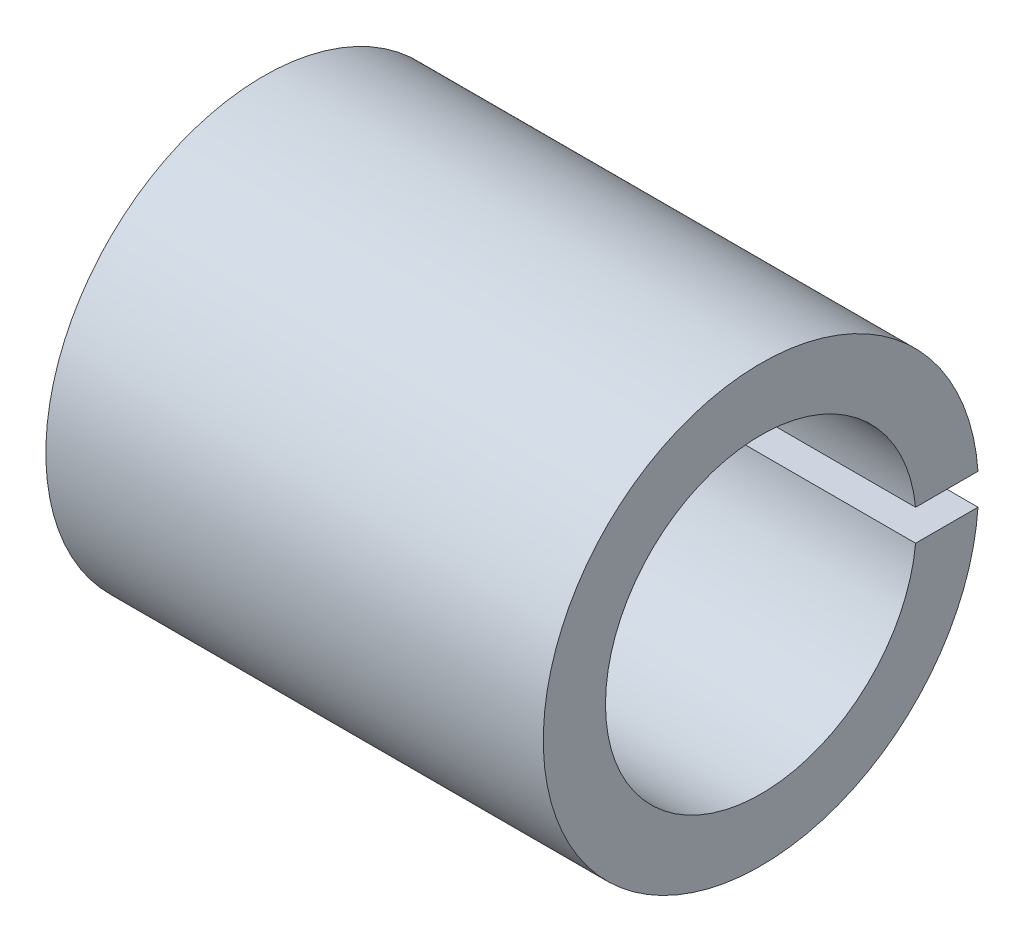
ISO-10303-21;
HEADER;
FILE_DESCRIPTION(('STEP AP214'),'2;1');
FILE_NAME('part.step','',(''),(''),'','','');
FILE_SCHEMA(('AUTOMOTIVE_DESIGN { 1 0 10303 214 1 1 1 1 }'));
ENDSEC;
DATA;
#1=APPLICATION_CONTEXT('core data for automotive mechanical design processes');
#2=APPLICATION_PROTOCOL_DEFINITION('international standard','automotive_design',2000,#1);
#3=PRODUCT_CONTEXT('',#1,'mechanical');
#4=PRODUCT('Part','Part','',(#3));
#5=PRODUCT_RELATED_PRODUCT_CATEGORY('part','',(#4));
#6=PRODUCT_DEFINITION_FORMATION('','',#4);
#7=PRODUCT_DEFINITION_CONTEXT('part definition',#1,'design');
#8=PRODUCT_DEFINITION('design','',#6,#7);
#9=PRODUCT_DEFINITION_SHAPE('','',#8);
#10=(LENGTH_UNIT() NAMED_UNIT(*) SI_UNIT(.MILLI.,.METRE.));
#11=(NAMED_UNIT(*) PLANE_ANGLE_UNIT() SI_UNIT($,.RADIAN.));
#12=(NAMED_UNIT(*) SI_UNIT($,.STERADIAN.) SOLID_ANGLE_UNIT());
#13=UNCERTAINTY_MEASURE_WITH_UNIT(LENGTH_MEASURE(1.E-05),#10,'distance_accuracy_value','');
#14=(GEOMETRIC_REPRESENTATION_CONTEXT(3) GLOBAL_UNCERTAINTY_ASSIGNED_CONTEXT((#13)) GLOBAL_UNIT_ASSIGNED_CONTEXT((#10,
#11,#12)) REPRESENTATION_CONTEXT('',''));
#15=CARTESIAN_POINT('',(0.,0.,0.));
#16=DIRECTION('',(0.,0.,1.));
#17=DIRECTION('',(1.,0.,0.));
#18=AXIS2_PLACEMENT_3D('',#15,#16,#17);
#19=CARTESIAN_POINT('',(8.,0.,0.));
#20=DIRECTION('',(-1.,0.,0.));
#21=DIRECTION('',(0.,0.,1.));
#22=AXIS2_PLACEMENT_3D('',#19,#20,#21);
#23=CYLINDRICAL_SURFACE('',#22,5.);
#24=CARTESIAN_POINT('',(-8.,0.,0.));
#25=DIRECTION('',(-1.,0.,0.));
#26=DIRECTION('',(0.,0.,-1.));
#27=AXIS2_PLACEMENT_3D('',#24,#25,#26);
#28=CIRCLE('',#27,5.);
#29=CARTESIAN_POINT('',(-8.,-0.5,-4.9749371855331));
#30=VERTEX_POINT('',#29);
#31=CARTESIAN_POINT('',(-8.,0.5,-4.9749371855331));
#32=VERTEX_POINT('',#31);
#33=EDGE_CURVE('E96',#30,#32,#28,.T.);
#34=ORIENTED_EDGE('',*,*,#33,.T.);
#35=DIRECTION('',(-1.,0.,0.));
#36=VECTOR('',#35,1.);
#37=CARTESIAN_POINT('',(8.,0.5,-4.9749371855331));
#38=LINE('',#37,#36);
#39=CARTESIAN_POINT('',(8.,0.5,-4.9749371855331));
#40=VERTEX_POINT('',#39);
#41=EDGE_CURVE('E11',#40,#32,#38,.T.);
#42=ORIENTED_EDGE('',*,*,#41,.F.);
#43=CARTESIAN_POINT('',(8.,0.,0.));
#44=DIRECTION('',(-1.,0.,0.));
#45=DIRECTION('',(0.,0.,-1.));
#46=AXIS2_PLACEMENT_3D('',#43,#44,#45);
#47=CIRCLE('',#46,5.);
#48=CARTESIAN_POINT('',(8.,-0.5,-4.9749371855331));
#49=VERTEX_POINT('',#48);
#50=EDGE_CURVE('E84',#49,#40,#47,.T.);
#51=ORIENTED_EDGE('',*,*,#50,.F.);
#52=DIRECTION('',(-1.,0.,0.));
#53=VECTOR('',#52,1.);
#54=CARTESIAN_POINT('',(8.,-0.5,-4.9749371855331));
#55=LINE('',#54,#53);
#56=EDGE_CURVE('E92',#49,#30,#55,.T.);
#57=ORIENTED_EDGE('',*,*,#56,.T.);
#58=EDGE_LOOP('',(#34,#42,#51,#57));
#59=FACE_BOUND('',#58,.T.);
#60=ADVANCED_FACE('F33',(#59),#23,.F.);
#61=CARTESIAN_POINT('',(8.,0.5,-4.9749371855331));
#62=DIRECTION('',(0.,1.,0.));
#63=DIRECTION('',(0.,0.,1.));
#64=AXIS2_PLACEMENT_3D('',#61,#62,#63);
#65=PLANE('',#64);
#66=DIRECTION('',(0.,0.,-1.));
#67=VECTOR('',#66,1.);
#68=CARTESIAN_POINT('',(-8.,0.5,-4.9749371855331));
#69=LINE('',#68,#67);
#70=CARTESIAN_POINT('',(-8.,0.5,-6.98212002188447));
#71=VERTEX_POINT('',#70);
#72=EDGE_CURVE('E88',#32,#71,#69,.T.);
#73=ORIENTED_EDGE('',*,*,#72,.T.);
#74=DIRECTION('',(-1.,0.,0.));
#75=VECTOR('',#74,1.);
#76=CARTESIAN_POINT('',(8.,0.5,-6.98212002188447));
#77=LINE('',#76,#75);
#78=CARTESIAN_POINT('',(8.,0.5,-6.98212002188447));
#79=VERTEX_POINT('',#78);
#80=EDGE_CURVE('E41',#79,#71,#77,.T.);
#81=ORIENTED_EDGE('',*,*,#80,.F.);
#82=DIRECTION('',(0.,0.,-1.));
#83=VECTOR('',#82,1.);
#84=CARTESIAN_POINT('',(8.,0.5,-4.9749371855331));
#85=LINE('',#84,#83);
#86=EDGE_CURVE('E79',#40,#79,#85,.T.);
#87=ORIENTED_EDGE('',*,*,#86,.F.);
#88=ORIENTED_EDGE('',*,*,#41,.T.);
#89=EDGE_LOOP('',(#73,#81,#87,#88));
#90=FACE_BOUND('',#89,.T.);
#91=ADVANCED_FACE('F87',(#90),#65,.F.);
#92=CARTESIAN_POINT('',(8.,0.,0.));
#93=DIRECTION('',(-1.,0.,0.));
#94=DIRECTION('',(0.,0.,1.));
#95=AXIS2_PLACEMENT_3D('',#92,#93,#94);
#96=CYLINDRICAL_SURFACE('',#95,7.);
#97=CARTESIAN_POINT('',(-8.,0.,0.));
#98=DIRECTION('',(1.,0.,0.));
#99=DIRECTION('',(0.,0.,-1.));
#100=AXIS2_PLACEMENT_3D('',#97,#98,#99);
#101=CIRCLE('',#100,7.);
#102=CARTESIAN_POINT('',(-8.,-0.500000000000002,-6.98212002188447));
#103=VERTEX_POINT('',#102);
#104=EDGE_CURVE('E66',#71,#103,#101,.T.);
#105=ORIENTED_EDGE('',*,*,#104,.T.);
#106=DIRECTION('',(-1.,0.,0.));
#107=VECTOR('',#106,1.);
#108=CARTESIAN_POINT('',(8.,-0.500000000000002,-6.98212002188447));
#109=LINE('',#108,#107);
#110=CARTESIAN_POINT('',(8.,-0.500000000000002,-6.98212002188447));
#111=VERTEX_POINT('',#110);
#112=EDGE_CURVE('E89',#111,#103,#109,.T.);
#113=ORIENTED_EDGE('',*,*,#112,.F.);
#114=CARTESIAN_POINT('',(8.,0.,0.));
#115=DIRECTION('',(1.,0.,0.));
#116=DIRECTION('',(0.,0.,-1.));
#117=AXIS2_PLACEMENT_3D('',#114,#115,#116);
#118=CIRCLE('',#117,7.);
#119=EDGE_CURVE('E82',#79,#111,#118,.T.);
#120=ORIENTED_EDGE('',*,*,#119,.F.);
#121=ORIENTED_EDGE('',*,*,#80,.T.);
#122=EDGE_LOOP('',(#105,#113,#120,#121));
#123=FACE_BOUND('',#122,.T.);
#124=ADVANCED_FACE('F90',(#123),#96,.T.);
#125=CARTESIAN_POINT('',(8.,-0.5,-4.9749371855331));
#126=DIRECTION('',(0.,-1.,0.));
#127=DIRECTION('',(0.,0.,-1.));
#128=AXIS2_PLACEMENT_3D('',#125,#126,#127);
#129=PLANE('',#128);
#130=DIRECTION('',(0.,0.,1.));
#131=VECTOR('',#130,1.);
#132=CARTESIAN_POINT('',(-8.,-0.5,-4.9749371855331));
#133=LINE('',#132,#131);
#134=EDGE_CURVE('E72',#103,#30,#133,.T.);
#135=ORIENTED_EDGE('',*,*,#134,.T.);
#136=ORIENTED_EDGE('',*,*,#56,.F.);
#137=DIRECTION('',(0.,0.,1.));
#138=VECTOR('',#137,1.);
#139=CARTESIAN_POINT('',(8.,-0.5,-4.9749371855331));
#140=LINE('',#139,#138);
#141=EDGE_CURVE('E49',#111,#49,#140,.T.);
#142=ORIENTED_EDGE('',*,*,#141,.F.);
#143=ORIENTED_EDGE('',*,*,#112,.T.);
#144=EDGE_LOOP('',(#135,#136,#142,#143));
#145=FACE_BOUND('',#144,.T.);
#146=ADVANCED_FACE('F103',(#145),#129,.F.);
#147=CARTESIAN_POINT('',(8.,0.,0.));
#148=DIRECTION('',(1.,0.,0.));
#149=DIRECTION('',(0.,0.,-1.));
#150=AXIS2_PLACEMENT_3D('',#147,#148,#149);
#151=PLANE('',#150);
#152=ORIENTED_EDGE('',*,*,#50,.T.);
#153=ORIENTED_EDGE('',*,*,#86,.T.);
#154=ORIENTED_EDGE('',*,*,#119,.T.);
#155=ORIENTED_EDGE('',*,*,#141,.T.);
#156=EDGE_LOOP('',(#152,#153,#154,#155));
#157=FACE_BOUND('',#156,.T.);
#158=ADVANCED_FACE('F80',(#157),#151,.T.);
#159=CARTESIAN_POINT('',(-8.,0.,0.));
#160=DIRECTION('',(1.,0.,0.));
#161=DIRECTION('',(0.,0.,-1.));
#162=AXIS2_PLACEMENT_3D('',#159,#160,#161);
#163=PLANE('',#162);
#164=ORIENTED_EDGE('',*,*,#33,.F.);
#165=ORIENTED_EDGE('',*,*,#134,.F.);
#166=ORIENTED_EDGE('',*,*,#104,.F.);
#167=ORIENTED_EDGE('',*,*,#72,.F.);
#168=EDGE_LOOP('',(#164,#165,#166,#167));
#169=FACE_BOUND('',#168,.T.);
#170=ADVANCED_FACE('F106',(#169),#163,.F.);
#171=CLOSED_SHELL('',(#60,#91,#124,#146,#158,#170));
#172=MANIFOLD_SOLID_BREP('B2',#171);
#173=ADVANCED_BREP_SHAPE_REPRESENTATION('',(#18,#172),#14);
#174=SHAPE_DEFINITION_REPRESENTATION(#9,#173);
ENDSEC;
END-ISO-10303-21;
